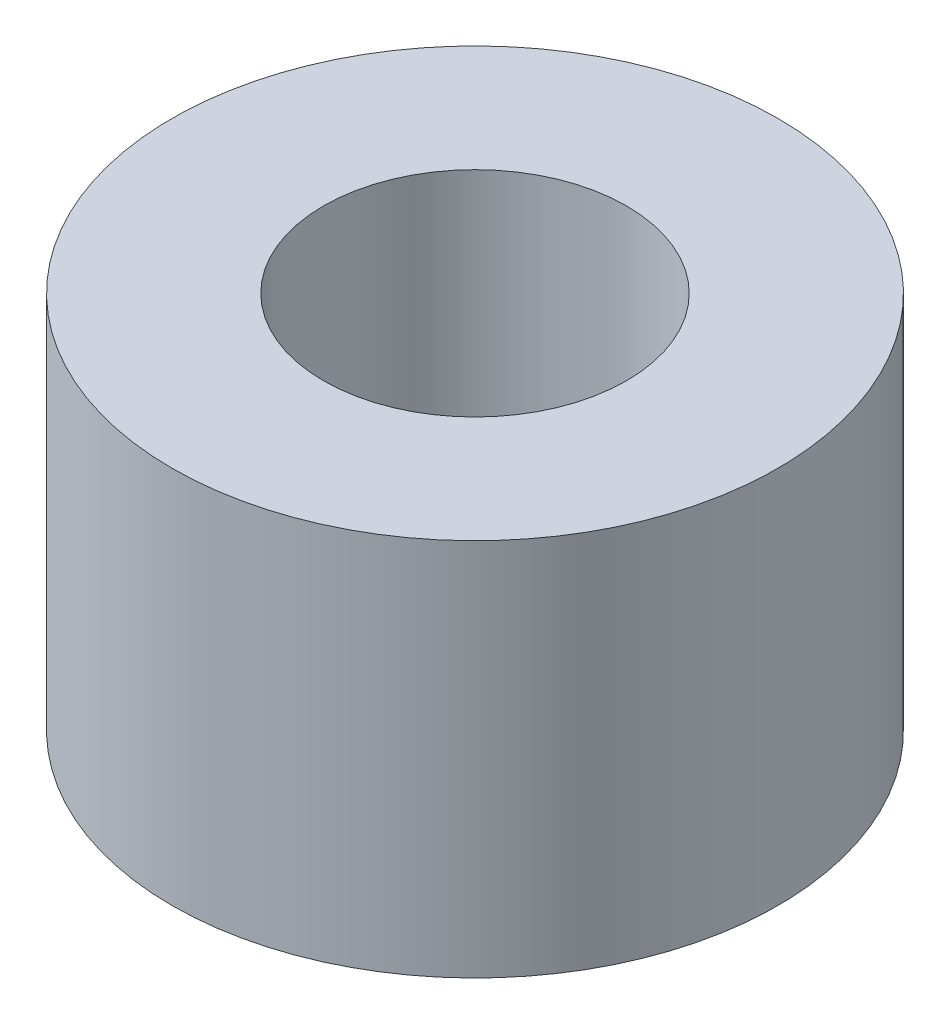
ISO-10303-21;
HEADER;
FILE_DESCRIPTION(('STEP AP214'),'2;1');
FILE_NAME('part.step','',(''),(''),'','','');
FILE_SCHEMA(('AUTOMOTIVE_DESIGN { 1 0 10303 214 1 1 1 1 }'));
ENDSEC;
DATA;
#1=APPLICATION_CONTEXT('core data for automotive mechanical design processes');
#2=APPLICATION_PROTOCOL_DEFINITION('international standard','automotive_design',2000,#1);
#3=PRODUCT_CONTEXT('',#1,'mechanical');
#4=PRODUCT('Part','Part','',(#3));
#5=PRODUCT_RELATED_PRODUCT_CATEGORY('part','',(#4));
#6=PRODUCT_DEFINITION_FORMATION('','',#4);
#7=PRODUCT_DEFINITION_CONTEXT('part definition',#1,'design');
#8=PRODUCT_DEFINITION('design','',#6,#7);
#9=PRODUCT_DEFINITION_SHAPE('','',#8);
#10=(LENGTH_UNIT() NAMED_UNIT(*) SI_UNIT(.MILLI.,.METRE.));
#11=(NAMED_UNIT(*) PLANE_ANGLE_UNIT() SI_UNIT($,.RADIAN.));
#12=(NAMED_UNIT(*) SI_UNIT($,.STERADIAN.) SOLID_ANGLE_UNIT());
#13=UNCERTAINTY_MEASURE_WITH_UNIT(LENGTH_MEASURE(1.E-05),#10,'distance_accuracy_value','');
#14=(GEOMETRIC_REPRESENTATION_CONTEXT(3) GLOBAL_UNCERTAINTY_ASSIGNED_CONTEXT((#13)) GLOBAL_UNIT_ASSIGNED_CONTEXT((#10,
#11,#12)) REPRESENTATION_CONTEXT('',''));
#15=CARTESIAN_POINT('',(0.,0.,0.));
#16=DIRECTION('',(0.,0.,1.));
#17=DIRECTION('',(1.,0.,0.));
#18=AXIS2_PLACEMENT_3D('',#15,#16,#17);
#19=CARTESIAN_POINT('',(0.,5.,0.));
#20=DIRECTION('',(0.,1.,0.));
#21=DIRECTION('',(0.,0.,1.));
#22=AXIS2_PLACEMENT_3D('',#19,#20,#21);
#23=PLANE('',#22);
#24=CARTESIAN_POINT('',(0.,5.,0.));
#25=DIRECTION('',(0.,1.,0.));
#26=DIRECTION('',(0.,0.,1.));
#27=AXIS2_PLACEMENT_3D('',#24,#25,#26);
#28=CIRCLE('',#27,4.);
#29=CARTESIAN_POINT('',(0.,5.,4.));
#30=VERTEX_POINT('',#29);
#31=EDGE_CURVE('E10',#30,#30,#28,.T.);
#32=ORIENTED_EDGE('',*,*,#31,.T.);
#33=EDGE_LOOP('',(#32));
#34=FACE_BOUND('',#33,.T.);
#35=CARTESIAN_POINT('',(0.,5.,0.));
#36=DIRECTION('',(0.,1.,0.));
#37=DIRECTION('',(0.,0.,1.));
#38=AXIS2_PLACEMENT_3D('',#35,#36,#37);
#39=CIRCLE('',#38,2.);
#40=CARTESIAN_POINT('',(0.,5.,2.));
#41=VERTEX_POINT('',#40);
#42=EDGE_CURVE('E43',#41,#41,#39,.T.);
#43=ORIENTED_EDGE('',*,*,#42,.F.);
#44=EDGE_LOOP('',(#43));
#45=FACE_BOUND('',#44,.T.);
#46=ADVANCED_FACE('F32',(#34,#45),#23,.T.);
#47=CARTESIAN_POINT('',(0.,0.,0.));
#48=DIRECTION('',(0.,1.,0.));
#49=DIRECTION('',(0.,0.,1.));
#50=AXIS2_PLACEMENT_3D('',#47,#48,#49);
#51=PLANE('',#50);
#52=CARTESIAN_POINT('',(0.,0.,0.));
#53=DIRECTION('',(0.,1.,0.));
#54=DIRECTION('',(0.,0.,1.));
#55=AXIS2_PLACEMENT_3D('',#52,#53,#54);
#56=CIRCLE('',#55,4.);
#57=CARTESIAN_POINT('',(0.,0.,4.));
#58=VERTEX_POINT('',#57);
#59=EDGE_CURVE('E36',#58,#58,#56,.T.);
#60=ORIENTED_EDGE('',*,*,#59,.F.);
#61=EDGE_LOOP('',(#60));
#62=FACE_BOUND('',#61,.T.);
#63=CARTESIAN_POINT('',(0.,0.,0.));
#64=DIRECTION('',(0.,1.,0.));
#65=DIRECTION('',(0.,0.,1.));
#66=AXIS2_PLACEMENT_3D('',#63,#64,#65);
#67=CIRCLE('',#66,2.);
#68=CARTESIAN_POINT('',(0.,0.,2.));
#69=VERTEX_POINT('',#68);
#70=EDGE_CURVE('E45',#69,#69,#67,.T.);
#71=ORIENTED_EDGE('',*,*,#70,.T.);
#72=EDGE_LOOP('',(#71));
#73=FACE_BOUND('',#72,.T.);
#74=ADVANCED_FACE('F55',(#62,#73),#51,.F.);
#75=CARTESIAN_POINT('',(0.,5.,0.));
#76=DIRECTION('',(0.,-1.,0.));
#77=DIRECTION('',(0.,0.,-1.));
#78=AXIS2_PLACEMENT_3D('',#75,#76,#77);
#79=CYLINDRICAL_SURFACE('',#78,4.);
#80=ORIENTED_EDGE('',*,*,#31,.F.);
#81=EDGE_LOOP('',(#80));
#82=FACE_BOUND('',#81,.T.);
#83=ORIENTED_EDGE('',*,*,#59,.T.);
#84=EDGE_LOOP('',(#83));
#85=FACE_BOUND('',#84,.T.);
#86=ADVANCED_FACE('F34',(#82,#85),#79,.T.);
#87=CARTESIAN_POINT('',(0.,5.,0.));
#88=DIRECTION('',(0.,-1.,0.));
#89=DIRECTION('',(0.,0.,-1.));
#90=AXIS2_PLACEMENT_3D('',#87,#88,#89);
#91=CYLINDRICAL_SURFACE('',#90,2.);
#92=ORIENTED_EDGE('',*,*,#42,.T.);
#93=EDGE_LOOP('',(#92));
#94=FACE_BOUND('',#93,.T.);
#95=ORIENTED_EDGE('',*,*,#70,.F.);
#96=EDGE_LOOP('',(#95));
#97=FACE_BOUND('',#96,.T.);
#98=ADVANCED_FACE('F51',(#94,#97),#91,.F.);
#99=CLOSED_SHELL('',(#46,#74,#86,#98));
#100=MANIFOLD_SOLID_BREP('B2',#99);
#101=ADVANCED_BREP_SHAPE_REPRESENTATION('',(#18,#100),#14);
#102=SHAPE_DEFINITION_REPRESENTATION(#9,#101);
ENDSEC;
END-ISO-10303-21;
